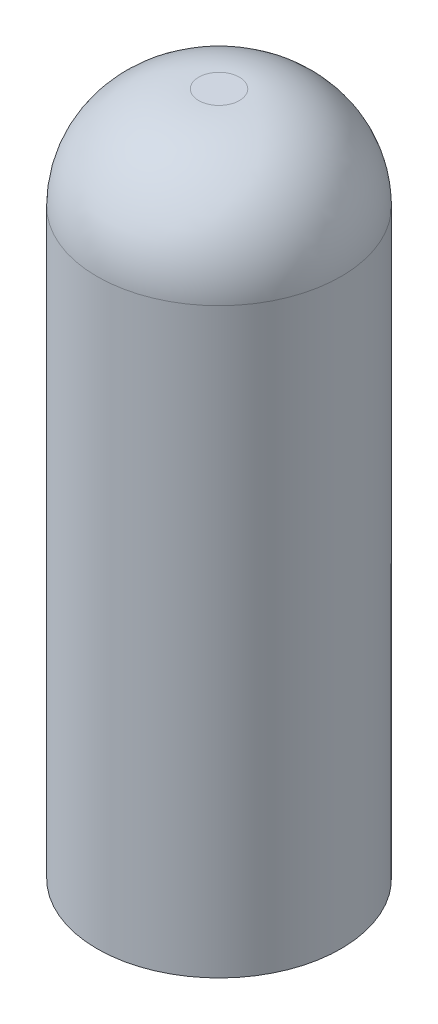
ISO-10303-21;
HEADER;
FILE_DESCRIPTION(('STEP AP214'),'2;1');
FILE_NAME('part.step','',(''),(''),'','','');
FILE_SCHEMA(('AUTOMOTIVE_DESIGN { 1 0 10303 214 1 1 1 1 }'));
ENDSEC;
DATA;
#1=APPLICATION_CONTEXT('core data for automotive mechanical design processes');
#2=APPLICATION_PROTOCOL_DEFINITION('international standard','automotive_design',2000,#1);
#3=PRODUCT_CONTEXT('',#1,'mechanical');
#4=PRODUCT('Part','Part','',(#3));
#5=PRODUCT_RELATED_PRODUCT_CATEGORY('part','',(#4));
#6=PRODUCT_DEFINITION_FORMATION('','',#4);
#7=PRODUCT_DEFINITION_CONTEXT('part definition',#1,'design');
#8=PRODUCT_DEFINITION('design','',#6,#7);
#9=PRODUCT_DEFINITION_SHAPE('','',#8);
#10=(LENGTH_UNIT() NAMED_UNIT(*) SI_UNIT(.MILLI.,.METRE.));
#11=(NAMED_UNIT(*) PLANE_ANGLE_UNIT() SI_UNIT($,.RADIAN.));
#12=(NAMED_UNIT(*) SI_UNIT($,.STERADIAN.) SOLID_ANGLE_UNIT());
#13=UNCERTAINTY_MEASURE_WITH_UNIT(LENGTH_MEASURE(1.E-05),#10,'distance_accuracy_value','');
#14=(GEOMETRIC_REPRESENTATION_CONTEXT(3) GLOBAL_UNCERTAINTY_ASSIGNED_CONTEXT((#13)) GLOBAL_UNIT_ASSIGNED_CONTEXT((#10,
#11,#12)) REPRESENTATION_CONTEXT('',''));
#15=CARTESIAN_POINT('',(0.,0.,0.));
#16=DIRECTION('',(0.,0.,1.));
#17=DIRECTION('',(1.,0.,0.));
#18=AXIS2_PLACEMENT_3D('',#15,#16,#17);
#19=CARTESIAN_POINT('',(0.,46.7079732218769,0.));
#20=DIRECTION('',(0.,-1.,0.));
#21=DIRECTION('',(0.,0.,-1.));
#22=AXIS2_PLACEMENT_3D('',#19,#20,#21);
#23=CYLINDRICAL_SURFACE('',#22,12.);
#24=CARTESIAN_POINT('',(0.,36.7079732218769,0.));
#25=DIRECTION('',(0.,1.,0.));
#26=DIRECTION('',(0.,0.,1.));
#27=AXIS2_PLACEMENT_3D('',#24,#25,#26);
#28=CIRCLE('',#27,12.);
#29=CARTESIAN_POINT('',(0.,36.7079732218769,12.));
#30=VERTEX_POINT('',#29);
#31=EDGE_CURVE('E10',#30,#30,#28,.F.);
#32=ORIENTED_EDGE('',*,*,#31,.T.);
#33=EDGE_LOOP('',(#32));
#34=FACE_BOUND('',#33,.T.);
#35=CARTESIAN_POINT('',(0.,-20.5920267781231,0.));
#36=DIRECTION('',(0.,1.,0.));
#37=DIRECTION('',(0.,0.,1.));
#38=AXIS2_PLACEMENT_3D('',#35,#36,#37);
#39=CIRCLE('',#38,12.);
#40=CARTESIAN_POINT('',(0.,-20.5920267781231,12.));
#41=VERTEX_POINT('',#40);
#42=EDGE_CURVE('E49',#41,#41,#39,.T.);
#43=ORIENTED_EDGE('',*,*,#42,.T.);
#44=EDGE_LOOP('',(#43));
#45=FACE_BOUND('',#44,.T.);
#46=ADVANCED_FACE('F36',(#34,#45),#23,.T.);
#47=CARTESIAN_POINT('',(0.,46.7079732218769,0.));
#48=DIRECTION('',(0.,1.,0.));
#49=DIRECTION('',(0.,0.,1.));
#50=AXIS2_PLACEMENT_3D('',#47,#48,#49);
#51=PLANE('',#50);
#52=CARTESIAN_POINT('',(0.,46.7079732218769,0.));
#53=DIRECTION('',(0.,1.,0.));
#54=DIRECTION('',(0.,0.,1.));
#55=AXIS2_PLACEMENT_3D('',#52,#53,#54);
#56=CIRCLE('',#55,2.);
#57=CARTESIAN_POINT('',(0.,46.7079732218769,2.));
#58=VERTEX_POINT('',#57);
#59=EDGE_CURVE('E44',#58,#58,#56,.T.);
#60=ORIENTED_EDGE('',*,*,#59,.T.);
#61=EDGE_LOOP('',(#60));
#62=FACE_BOUND('',#61,.T.);
#63=ADVANCED_FACE('F77',(#62),#51,.T.);
#64=CARTESIAN_POINT('',(0.,-20.5920267781231,0.));
#65=DIRECTION('',(0.,1.,0.));
#66=DIRECTION('',(0.,0.,1.));
#67=AXIS2_PLACEMENT_3D('',#64,#65,#66);
#68=PLANE('',#67);
#69=CARTESIAN_POINT('',(0.,-20.5920267781231,0.));
#70=DIRECTION('',(0.,1.,0.));
#71=DIRECTION('',(0.,0.,1.));
#72=AXIS2_PLACEMENT_3D('',#69,#70,#71);
#73=CIRCLE('',#72,10.);
#74=CARTESIAN_POINT('',(0.,-20.5920267781231,10.));
#75=VERTEX_POINT('',#74);
#76=EDGE_CURVE('E57',#75,#75,#73,.T.);
#77=ORIENTED_EDGE('',*,*,#76,.T.);
#78=EDGE_LOOP('',(#77));
#79=FACE_BOUND('',#78,.T.);
#80=ORIENTED_EDGE('',*,*,#42,.F.);
#81=EDGE_LOOP('',(#80));
#82=FACE_BOUND('',#81,.T.);
#83=ADVANCED_FACE('F81',(#79,#82),#68,.F.);
#84=CARTESIAN_POINT('',(0.,36.7079732218769,0.));
#85=DIRECTION('',(0.,1.,0.));
#86=DIRECTION('',(0.,0.,1.));
#87=AXIS2_PLACEMENT_3D('',#84,#85,#86);
#88=DEGENERATE_TOROIDAL_SURFACE('',#87,2.,10.,.T.);
#89=ORIENTED_EDGE('',*,*,#31,.F.);
#90=EDGE_LOOP('',(#89));
#91=FACE_BOUND('',#90,.T.);
#92=ORIENTED_EDGE('',*,*,#59,.F.);
#93=EDGE_LOOP('',(#92));
#94=FACE_BOUND('',#93,.T.);
#95=ADVANCED_FACE('F38',(#91,#94),#88,.T.);
#96=CARTESIAN_POINT('',(0.,46.7079732218769,0.));
#97=DIRECTION('',(0.,-1.,0.));
#98=DIRECTION('',(0.,0.,-1.));
#99=AXIS2_PLACEMENT_3D('',#96,#97,#98);
#100=CYLINDRICAL_SURFACE('',#99,10.);
#101=CARTESIAN_POINT('',(0.,26.7079732218769,0.));
#102=DIRECTION('',(0.,1.,0.));
#103=DIRECTION('',(0.,0.,1.));
#104=AXIS2_PLACEMENT_3D('',#101,#102,#103);
#105=CIRCLE('',#104,10.);
#106=CARTESIAN_POINT('',(0.,26.7079732218769,10.));
#107=VERTEX_POINT('',#106);
#108=EDGE_CURVE('E54',#107,#107,#105,.T.);
#109=ORIENTED_EDGE('',*,*,#108,.T.);
#110=EDGE_LOOP('',(#109));
#111=FACE_BOUND('',#110,.T.);
#112=ORIENTED_EDGE('',*,*,#76,.F.);
#113=EDGE_LOOP('',(#112));
#114=FACE_BOUND('',#113,.T.);
#115=ADVANCED_FACE('F65',(#111,#114),#100,.F.);
#116=CARTESIAN_POINT('',(0.,26.7079732218769,0.));
#117=DIRECTION('',(0.,1.,0.));
#118=DIRECTION('',(0.,0.,1.));
#119=AXIS2_PLACEMENT_3D('',#116,#117,#118);
#120=PLANE('',#119);
#121=ORIENTED_EDGE('',*,*,#108,.F.);
#122=EDGE_LOOP('',(#121));
#123=FACE_BOUND('',#122,.T.);
#124=ADVANCED_FACE('F68',(#123),#120,.F.);
#125=CLOSED_SHELL('',(#46,#63,#83,#95,#115,#124));
#126=MANIFOLD_SOLID_BREP('B2',#125);
#127=ADVANCED_BREP_SHAPE_REPRESENTATION('',(#18,#126),#14);
#128=SHAPE_DEFINITION_REPRESENTATION(#9,#127);
ENDSEC;
END-ISO-10303-21;
